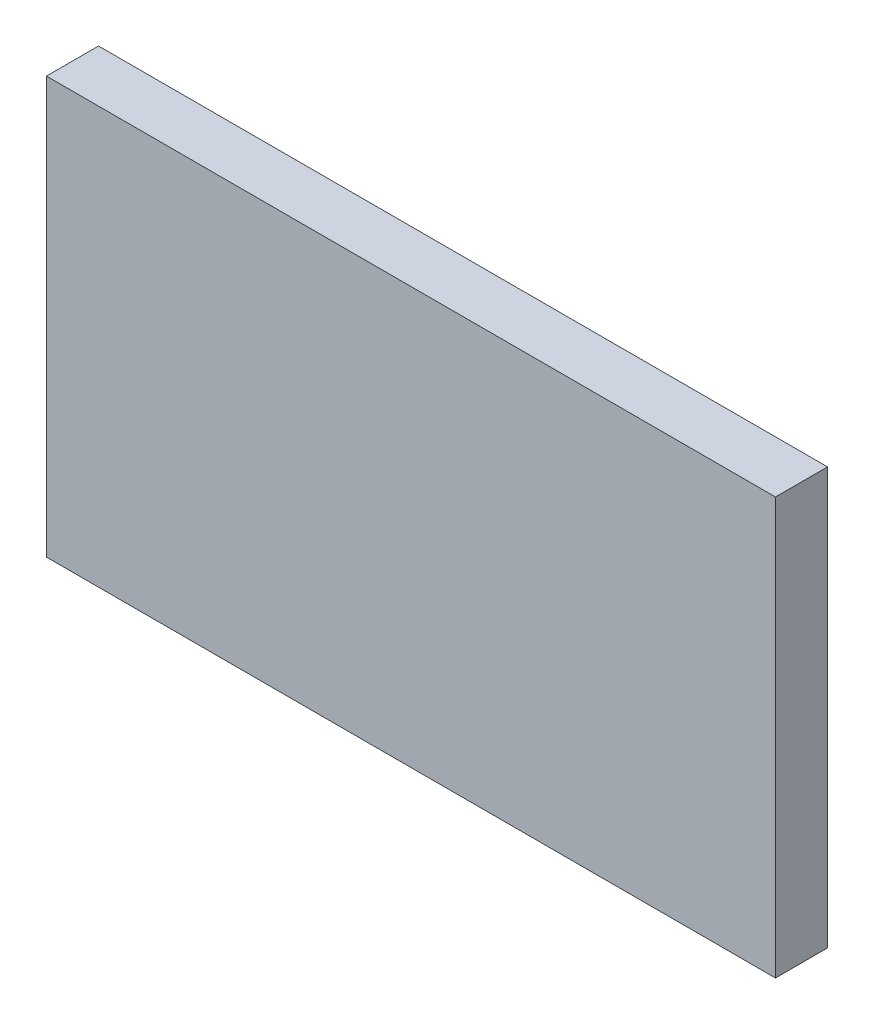
ISO-10303-21;
HEADER;
FILE_DESCRIPTION(('STEP AP214'),'2;1');
FILE_NAME('part.step','',(''),(''),'','','');
FILE_SCHEMA(('AUTOMOTIVE_DESIGN { 1 0 10303 214 1 1 1 1 }'));
ENDSEC;
DATA;
#1=APPLICATION_CONTEXT('core data for automotive mechanical design processes');
#2=APPLICATION_PROTOCOL_DEFINITION('international standard','automotive_design',2000,#1);
#3=PRODUCT_CONTEXT('',#1,'mechanical');
#4=PRODUCT('Part','Part','',(#3));
#5=PRODUCT_RELATED_PRODUCT_CATEGORY('part','',(#4));
#6=PRODUCT_DEFINITION_FORMATION('','',#4);
#7=PRODUCT_DEFINITION_CONTEXT('part definition',#1,'design');
#8=PRODUCT_DEFINITION('design','',#6,#7);
#9=PRODUCT_DEFINITION_SHAPE('','',#8);
#10=(LENGTH_UNIT() NAMED_UNIT(*) SI_UNIT(.MILLI.,.METRE.));
#11=(NAMED_UNIT(*) PLANE_ANGLE_UNIT() SI_UNIT($,.RADIAN.));
#12=(NAMED_UNIT(*) SI_UNIT($,.STERADIAN.) SOLID_ANGLE_UNIT());
#13=UNCERTAINTY_MEASURE_WITH_UNIT(LENGTH_MEASURE(1.E-05),#10,'distance_accuracy_value','');
#14=(GEOMETRIC_REPRESENTATION_CONTEXT(3) GLOBAL_UNCERTAINTY_ASSIGNED_CONTEXT((#13)) GLOBAL_UNIT_ASSIGNED_CONTEXT((#10,
#11,#12)) REPRESENTATION_CONTEXT('',''));
#15=CARTESIAN_POINT('',(0.,0.,0.));
#16=DIRECTION('',(0.,0.,1.));
#17=DIRECTION('',(1.,0.,0.));
#18=AXIS2_PLACEMENT_3D('',#15,#16,#17);
#19=CARTESIAN_POINT('',(-0.7,0.2,0.));
#20=DIRECTION('',(1.,0.,0.));
#21=DIRECTION('',(0.,0.,1.));
#22=AXIS2_PLACEMENT_3D('',#19,#20,#21);
#23=PLANE('',#22);
#24=DIRECTION('',(0.,1.,0.));
#25=VECTOR('',#24,1.);
#26=CARTESIAN_POINT('',(-0.7,0.2,0.1));
#27=LINE('',#26,#25);
#28=CARTESIAN_POINT('',(-0.7,0.2,0.1));
#29=VERTEX_POINT('',#28);
#30=CARTESIAN_POINT('',(-0.7,1.,0.1));
#31=VERTEX_POINT('',#30);
#32=EDGE_CURVE('E11',#29,#31,#27,.T.);
#33=ORIENTED_EDGE('',*,*,#32,.T.);
#34=DIRECTION('',(0.,0.,1.));
#35=VECTOR('',#34,1.);
#36=CARTESIAN_POINT('',(-0.7,1.,0.));
#37=LINE('',#36,#35);
#38=CARTESIAN_POINT('',(-0.7,1.,0.));
#39=VERTEX_POINT('',#38);
#40=EDGE_CURVE('E24',#39,#31,#37,.T.);
#41=ORIENTED_EDGE('',*,*,#40,.F.);
#42=DIRECTION('',(0.,1.,0.));
#43=VECTOR('',#42,1.);
#44=CARTESIAN_POINT('',(-0.7,0.2,0.));
#45=LINE('',#44,#43);
#46=CARTESIAN_POINT('',(-0.7,0.2,0.));
#47=VERTEX_POINT('',#46);
#48=EDGE_CURVE('E86',#47,#39,#45,.T.);
#49=ORIENTED_EDGE('',*,*,#48,.F.);
#50=DIRECTION('',(0.,0.,1.));
#51=VECTOR('',#50,1.);
#52=CARTESIAN_POINT('',(-0.7,0.2,0.));
#53=LINE('',#52,#51);
#54=EDGE_CURVE('E36',#47,#29,#53,.T.);
#55=ORIENTED_EDGE('',*,*,#54,.T.);
#56=EDGE_LOOP('',(#33,#41,#49,#55));
#57=FACE_BOUND('',#56,.T.);
#58=ADVANCED_FACE('F17',(#57),#23,.F.);
#59=CARTESIAN_POINT('',(0.7,0.2,0.));
#60=DIRECTION('',(1.,0.,0.));
#61=DIRECTION('',(0.,0.,1.));
#62=AXIS2_PLACEMENT_3D('',#59,#60,#61);
#63=PLANE('',#62);
#64=DIRECTION('',(0.,0.,1.));
#65=VECTOR('',#64,1.);
#66=CARTESIAN_POINT('',(0.7,0.2,0.));
#67=LINE('',#66,#65);
#68=CARTESIAN_POINT('',(0.7,0.2,0.));
#69=VERTEX_POINT('',#68);
#70=CARTESIAN_POINT('',(0.7,0.2,0.1));
#71=VERTEX_POINT('',#70);
#72=EDGE_CURVE('E83',#69,#71,#67,.T.);
#73=ORIENTED_EDGE('',*,*,#72,.F.);
#74=DIRECTION('',(0.,1.,0.));
#75=VECTOR('',#74,1.);
#76=CARTESIAN_POINT('',(0.7,0.2,0.));
#77=LINE('',#76,#75);
#78=CARTESIAN_POINT('',(0.7,1.,0.));
#79=VERTEX_POINT('',#78);
#80=EDGE_CURVE('E63',#69,#79,#77,.T.);
#81=ORIENTED_EDGE('',*,*,#80,.T.);
#82=DIRECTION('',(0.,0.,1.));
#83=VECTOR('',#82,1.);
#84=CARTESIAN_POINT('',(0.7,1.,0.));
#85=LINE('',#84,#83);
#86=CARTESIAN_POINT('',(0.7,1.,0.1));
#87=VERTEX_POINT('',#86);
#88=EDGE_CURVE('E57',#79,#87,#85,.T.);
#89=ORIENTED_EDGE('',*,*,#88,.T.);
#90=DIRECTION('',(0.,1.,0.));
#91=VECTOR('',#90,1.);
#92=CARTESIAN_POINT('',(0.7,0.2,0.1));
#93=LINE('',#92,#91);
#94=EDGE_CURVE('E60',#71,#87,#93,.T.);
#95=ORIENTED_EDGE('',*,*,#94,.F.);
#96=EDGE_LOOP('',(#73,#81,#89,#95));
#97=FACE_BOUND('',#96,.T.);
#98=ADVANCED_FACE('F59',(#97),#63,.T.);
#99=CARTESIAN_POINT('',(-0.7,0.2,0.));
#100=DIRECTION('',(0.,1.,0.));
#101=DIRECTION('',(0.,0.,1.));
#102=AXIS2_PLACEMENT_3D('',#99,#100,#101);
#103=PLANE('',#102);
#104=ORIENTED_EDGE('',*,*,#72,.T.);
#105=DIRECTION('',(1.,0.,0.));
#106=VECTOR('',#105,1.);
#107=CARTESIAN_POINT('',(-0.7,0.2,0.1));
#108=LINE('',#107,#106);
#109=EDGE_CURVE('E71',#29,#71,#108,.T.);
#110=ORIENTED_EDGE('',*,*,#109,.F.);
#111=ORIENTED_EDGE('',*,*,#54,.F.);
#112=DIRECTION('',(1.,0.,0.));
#113=VECTOR('',#112,1.);
#114=CARTESIAN_POINT('',(-0.7,0.2,0.));
#115=LINE('',#114,#113);
#116=EDGE_CURVE('E76',#47,#69,#115,.T.);
#117=ORIENTED_EDGE('',*,*,#116,.T.);
#118=EDGE_LOOP('',(#104,#110,#111,#117));
#119=FACE_BOUND('',#118,.T.);
#120=ADVANCED_FACE('F91',(#119),#103,.F.);
#121=CARTESIAN_POINT('',(-0.7,1.,0.));
#122=DIRECTION('',(0.,1.,0.));
#123=DIRECTION('',(0.,0.,1.));
#124=AXIS2_PLACEMENT_3D('',#121,#122,#123);
#125=PLANE('',#124);
#126=DIRECTION('',(1.,0.,0.));
#127=VECTOR('',#126,1.);
#128=CARTESIAN_POINT('',(-0.7,1.,0.));
#129=LINE('',#128,#127);
#130=EDGE_CURVE('E74',#39,#79,#129,.T.);
#131=ORIENTED_EDGE('',*,*,#130,.F.);
#132=ORIENTED_EDGE('',*,*,#40,.T.);
#133=DIRECTION('',(1.,0.,0.));
#134=VECTOR('',#133,1.);
#135=CARTESIAN_POINT('',(-0.7,1.,0.1));
#136=LINE('',#135,#134);
#137=EDGE_CURVE('E69',#31,#87,#136,.T.);
#138=ORIENTED_EDGE('',*,*,#137,.T.);
#139=ORIENTED_EDGE('',*,*,#88,.F.);
#140=EDGE_LOOP('',(#131,#132,#138,#139));
#141=FACE_BOUND('',#140,.T.);
#142=ADVANCED_FACE('F73',(#141),#125,.T.);
#143=CARTESIAN_POINT('',(-0.7,0.2,0.));
#144=DIRECTION('',(0.,0.,1.));
#145=DIRECTION('',(1.,0.,0.));
#146=AXIS2_PLACEMENT_3D('',#143,#144,#145);
#147=PLANE('',#146);
#148=ORIENTED_EDGE('',*,*,#130,.T.);
#149=ORIENTED_EDGE('',*,*,#80,.F.);
#150=ORIENTED_EDGE('',*,*,#116,.F.);
#151=ORIENTED_EDGE('',*,*,#48,.T.);
#152=EDGE_LOOP('',(#148,#149,#150,#151));
#153=FACE_BOUND('',#152,.T.);
#154=ADVANCED_FACE('F89',(#153),#147,.F.);
#155=CARTESIAN_POINT('',(-0.7,0.2,0.1));
#156=DIRECTION('',(0.,0.,1.));
#157=DIRECTION('',(1.,0.,0.));
#158=AXIS2_PLACEMENT_3D('',#155,#156,#157);
#159=PLANE('',#158);
#160=ORIENTED_EDGE('',*,*,#32,.F.);
#161=ORIENTED_EDGE('',*,*,#109,.T.);
#162=ORIENTED_EDGE('',*,*,#94,.T.);
#163=ORIENTED_EDGE('',*,*,#137,.F.);
#164=EDGE_LOOP('',(#160,#161,#162,#163));
#165=FACE_BOUND('',#164,.T.);
#166=ADVANCED_FACE('F68',(#165),#159,.T.);
#167=CLOSED_SHELL('',(#58,#98,#120,#142,#154,#166));
#168=MANIFOLD_SOLID_BREP('B1',#167);
#169=ADVANCED_BREP_SHAPE_REPRESENTATION('',(#18,#168),#14);
#170=SHAPE_DEFINITION_REPRESENTATION(#9,#169);
ENDSEC;
END-ISO-10303-21;
